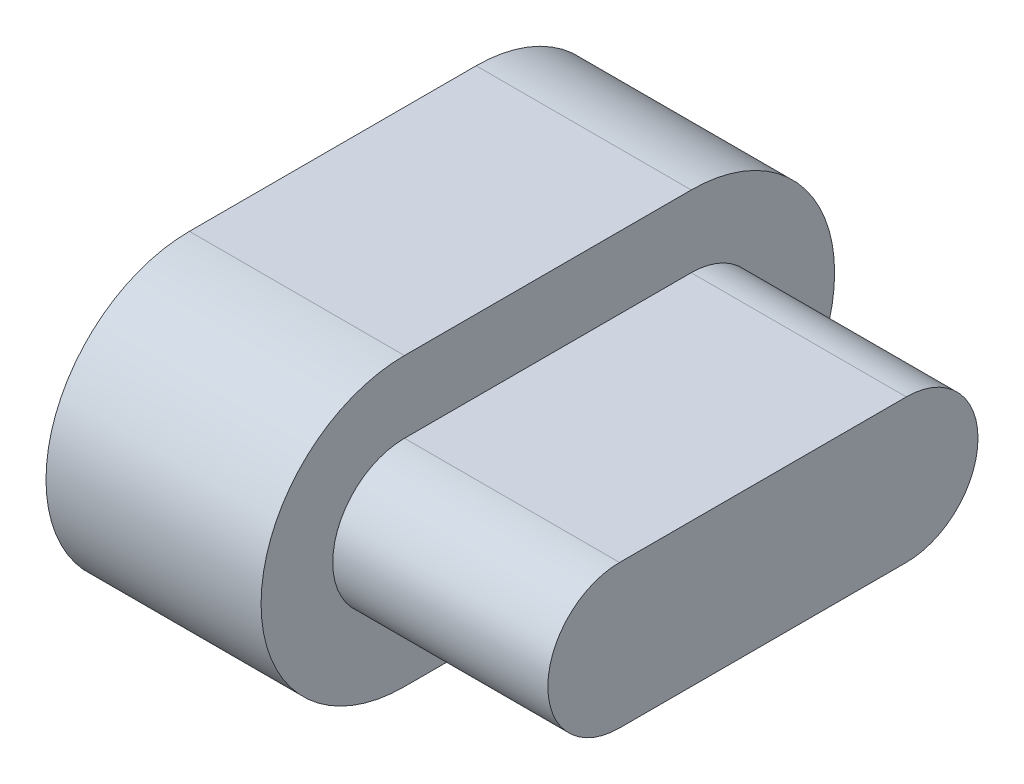
ISO-10303-21;
HEADER;
FILE_DESCRIPTION(('STEP AP214'),'2;1');
FILE_NAME('part.step','',(''),(''),'','','');
FILE_SCHEMA(('AUTOMOTIVE_DESIGN { 1 0 10303 214 1 1 1 1 }'));
ENDSEC;
DATA;
#1=APPLICATION_CONTEXT('core data for automotive mechanical design processes');
#2=APPLICATION_PROTOCOL_DEFINITION('international standard','automotive_design',2000,#1);
#3=PRODUCT_CONTEXT('',#1,'mechanical');
#4=PRODUCT('Part','Part','',(#3));
#5=PRODUCT_RELATED_PRODUCT_CATEGORY('part','',(#4));
#6=PRODUCT_DEFINITION_FORMATION('','',#4);
#7=PRODUCT_DEFINITION_CONTEXT('part definition',#1,'design');
#8=PRODUCT_DEFINITION('design','',#6,#7);
#9=PRODUCT_DEFINITION_SHAPE('','',#8);
#10=(LENGTH_UNIT() NAMED_UNIT(*) SI_UNIT(.MILLI.,.METRE.));
#11=(NAMED_UNIT(*) PLANE_ANGLE_UNIT() SI_UNIT($,.RADIAN.));
#12=(NAMED_UNIT(*) SI_UNIT($,.STERADIAN.) SOLID_ANGLE_UNIT());
#13=UNCERTAINTY_MEASURE_WITH_UNIT(LENGTH_MEASURE(1.E-05),#10,'distance_accuracy_value','');
#14=(GEOMETRIC_REPRESENTATION_CONTEXT(3) GLOBAL_UNCERTAINTY_ASSIGNED_CONTEXT((#13)) GLOBAL_UNIT_ASSIGNED_CONTEXT((#10,
#11,#12)) REPRESENTATION_CONTEXT('',''));
#15=CARTESIAN_POINT('',(0.,0.,0.));
#16=DIRECTION('',(0.,0.,1.));
#17=DIRECTION('',(1.,0.,0.));
#18=AXIS2_PLACEMENT_3D('',#15,#16,#17);
#19=CARTESIAN_POINT('',(3.,0.,2.));
#20=DIRECTION('',(1.,0.,0.));
#21=DIRECTION('',(0.,0.,-1.));
#22=AXIS2_PLACEMENT_3D('',#19,#20,#21);
#23=PLANE('',#22);
#24=CARTESIAN_POINT('',(3.,0.,2.));
#25=DIRECTION('',(1.,0.,0.));
#26=DIRECTION('',(0.,0.,-1.));
#27=AXIS2_PLACEMENT_3D('',#24,#25,#26);
#28=CIRCLE('',#27,2.);
#29=CARTESIAN_POINT('',(3.,2.,2.));
#30=VERTEX_POINT('',#29);
#31=CARTESIAN_POINT('',(3.,-2.,2.));
#32=VERTEX_POINT('',#31);
#33=EDGE_CURVE('E142',#30,#32,#28,.T.);
#34=ORIENTED_EDGE('',*,*,#33,.T.);
#35=DIRECTION('',(0.,0.,-1.));
#36=VECTOR('',#35,1.);
#37=CARTESIAN_POINT('',(3.,-2.,2.));
#38=LINE('',#37,#36);
#39=CARTESIAN_POINT('',(3.,-2.,-2.));
#40=VERTEX_POINT('',#39);
#41=EDGE_CURVE('E87',#32,#40,#38,.T.);
#42=ORIENTED_EDGE('',*,*,#41,.T.);
#43=CARTESIAN_POINT('',(3.,0.,-2.));
#44=DIRECTION('',(1.,0.,0.));
#45=DIRECTION('',(0.,0.,-1.));
#46=AXIS2_PLACEMENT_3D('',#43,#44,#45);
#47=CIRCLE('',#46,2.);
#48=CARTESIAN_POINT('',(3.,2.,-2.));
#49=VERTEX_POINT('',#48);
#50=EDGE_CURVE('E145',#40,#49,#47,.T.);
#51=ORIENTED_EDGE('',*,*,#50,.T.);
#52=DIRECTION('',(0.,0.,1.));
#53=VECTOR('',#52,1.);
#54=CARTESIAN_POINT('',(3.,2.,2.));
#55=LINE('',#54,#53);
#56=EDGE_CURVE('E59',#49,#30,#55,.T.);
#57=ORIENTED_EDGE('',*,*,#56,.T.);
#58=EDGE_LOOP('',(#34,#42,#51,#57));
#59=FACE_BOUND('',#58,.T.);
#60=DIRECTION('',(0.,0.,-1.));
#61=VECTOR('',#60,1.);
#62=CARTESIAN_POINT('',(3.,-1.,2.));
#63=LINE('',#62,#61);
#64=CARTESIAN_POINT('',(3.,-1.,2.));
#65=VERTEX_POINT('',#64);
#66=CARTESIAN_POINT('',(3.,-1.,-2.));
#67=VERTEX_POINT('',#66);
#68=EDGE_CURVE('E265',#65,#67,#63,.T.);
#69=ORIENTED_EDGE('',*,*,#68,.F.);
#70=CARTESIAN_POINT('',(3.,0.,2.));
#71=DIRECTION('',(1.,0.,0.));
#72=DIRECTION('',(0.,0.,-1.));
#73=AXIS2_PLACEMENT_3D('',#70,#71,#72);
#74=CIRCLE('',#73,1.);
#75=CARTESIAN_POINT('',(3.,1.,2.));
#76=VERTEX_POINT('',#75);
#77=EDGE_CURVE('E132',#76,#65,#74,.T.);
#78=ORIENTED_EDGE('',*,*,#77,.F.);
#79=DIRECTION('',(0.,0.,1.));
#80=VECTOR('',#79,1.);
#81=CARTESIAN_POINT('',(3.,1.,-2.));
#82=LINE('',#81,#80);
#83=CARTESIAN_POINT('',(3.,1.,-2.));
#84=VERTEX_POINT('',#83);
#85=EDGE_CURVE('E128',#84,#76,#82,.T.);
#86=ORIENTED_EDGE('',*,*,#85,.F.);
#87=CARTESIAN_POINT('',(3.,0.,-2.));
#88=DIRECTION('',(1.,0.,0.));
#89=DIRECTION('',(0.,0.,-1.));
#90=AXIS2_PLACEMENT_3D('',#87,#88,#89);
#91=CIRCLE('',#90,1.);
#92=EDGE_CURVE('E262',#67,#84,#91,.T.);
#93=ORIENTED_EDGE('',*,*,#92,.F.);
#94=EDGE_LOOP('',(#69,#78,#86,#93));
#95=FACE_BOUND('',#94,.T.);
#96=ADVANCED_FACE('F35',(#59,#95),#23,.T.);
#97=CARTESIAN_POINT('',(3.,0.,2.));
#98=DIRECTION('',(-1.,0.,0.));
#99=DIRECTION('',(0.,0.,1.));
#100=AXIS2_PLACEMENT_3D('',#97,#98,#99);
#101=CYLINDRICAL_SURFACE('',#100,2.);
#102=CARTESIAN_POINT('',(0.,0.,2.));
#103=DIRECTION('',(1.,0.,0.));
#104=DIRECTION('',(0.,0.,-1.));
#105=AXIS2_PLACEMENT_3D('',#102,#103,#104);
#106=CIRCLE('',#105,2.);
#107=CARTESIAN_POINT('',(0.,2.,2.));
#108=VERTEX_POINT('',#107);
#109=CARTESIAN_POINT('',(0.,-2.,2.));
#110=VERTEX_POINT('',#109);
#111=EDGE_CURVE('E134',#108,#110,#106,.T.);
#112=ORIENTED_EDGE('',*,*,#111,.T.);
#113=DIRECTION('',(-1.,0.,0.));
#114=VECTOR('',#113,1.);
#115=CARTESIAN_POINT('',(3.,-2.,2.));
#116=LINE('',#115,#114);
#117=EDGE_CURVE('E11',#32,#110,#116,.T.);
#118=ORIENTED_EDGE('',*,*,#117,.F.);
#119=ORIENTED_EDGE('',*,*,#33,.F.);
#120=DIRECTION('',(-1.,0.,0.));
#121=VECTOR('',#120,1.);
#122=CARTESIAN_POINT('',(3.,2.,2.));
#123=LINE('',#122,#121);
#124=EDGE_CURVE('E147',#30,#108,#123,.T.);
#125=ORIENTED_EDGE('',*,*,#124,.T.);
#126=EDGE_LOOP('',(#112,#118,#119,#125));
#127=FACE_BOUND('',#126,.T.);
#128=ADVANCED_FACE('F37',(#127),#101,.T.);
#129=CARTESIAN_POINT('',(3.,-2.,2.));
#130=DIRECTION('',(0.,1.,0.));
#131=DIRECTION('',(0.,0.,1.));
#132=AXIS2_PLACEMENT_3D('',#129,#130,#131);
#133=PLANE('',#132);
#134=DIRECTION('',(0.,0.,-1.));
#135=VECTOR('',#134,1.);
#136=CARTESIAN_POINT('',(0.,-2.,2.));
#137=LINE('',#136,#135);
#138=CARTESIAN_POINT('',(0.,-2.,-2.));
#139=VERTEX_POINT('',#138);
#140=EDGE_CURVE('E137',#110,#139,#137,.T.);
#141=ORIENTED_EDGE('',*,*,#140,.T.);
#142=DIRECTION('',(-1.,0.,0.));
#143=VECTOR('',#142,1.);
#144=CARTESIAN_POINT('',(3.,-2.,-2.));
#145=LINE('',#144,#143);
#146=EDGE_CURVE('E43',#40,#139,#145,.T.);
#147=ORIENTED_EDGE('',*,*,#146,.F.);
#148=ORIENTED_EDGE('',*,*,#41,.F.);
#149=ORIENTED_EDGE('',*,*,#117,.T.);
#150=EDGE_LOOP('',(#141,#147,#148,#149));
#151=FACE_BOUND('',#150,.T.);
#152=ADVANCED_FACE('F175',(#151),#133,.F.);
#153=CARTESIAN_POINT('',(3.,0.,-2.));
#154=DIRECTION('',(-1.,0.,0.));
#155=DIRECTION('',(0.,0.,1.));
#156=AXIS2_PLACEMENT_3D('',#153,#154,#155);
#157=CYLINDRICAL_SURFACE('',#156,2.);
#158=CARTESIAN_POINT('',(0.,0.,-2.));
#159=DIRECTION('',(1.,0.,0.));
#160=DIRECTION('',(0.,0.,-1.));
#161=AXIS2_PLACEMENT_3D('',#158,#159,#160);
#162=CIRCLE('',#161,2.);
#163=CARTESIAN_POINT('',(0.,2.,-2.));
#164=VERTEX_POINT('',#163);
#165=EDGE_CURVE('E150',#139,#164,#162,.T.);
#166=ORIENTED_EDGE('',*,*,#165,.T.);
#167=DIRECTION('',(-1.,0.,0.));
#168=VECTOR('',#167,1.);
#169=CARTESIAN_POINT('',(3.,2.,-2.));
#170=LINE('',#169,#168);
#171=EDGE_CURVE('E154',#49,#164,#170,.T.);
#172=ORIENTED_EDGE('',*,*,#171,.F.);
#173=ORIENTED_EDGE('',*,*,#50,.F.);
#174=ORIENTED_EDGE('',*,*,#146,.T.);
#175=EDGE_LOOP('',(#166,#172,#173,#174));
#176=FACE_BOUND('',#175,.T.);
#177=ADVANCED_FACE('F159',(#176),#157,.T.);
#178=CARTESIAN_POINT('',(3.,2.,2.));
#179=DIRECTION('',(0.,-1.,0.));
#180=DIRECTION('',(0.,0.,-1.));
#181=AXIS2_PLACEMENT_3D('',#178,#179,#180);
#182=PLANE('',#181);
#183=DIRECTION('',(0.,0.,1.));
#184=VECTOR('',#183,1.);
#185=CARTESIAN_POINT('',(0.,2.,2.));
#186=LINE('',#185,#184);
#187=EDGE_CURVE('E80',#164,#108,#186,.T.);
#188=ORIENTED_EDGE('',*,*,#187,.T.);
#189=ORIENTED_EDGE('',*,*,#124,.F.);
#190=ORIENTED_EDGE('',*,*,#56,.F.);
#191=ORIENTED_EDGE('',*,*,#171,.T.);
#192=EDGE_LOOP('',(#188,#189,#190,#191));
#193=FACE_BOUND('',#192,.T.);
#194=ADVANCED_FACE('F167',(#193),#182,.F.);
#195=CARTESIAN_POINT('',(0.,0.,2.));
#196=DIRECTION('',(1.,0.,0.));
#197=DIRECTION('',(0.,0.,-1.));
#198=AXIS2_PLACEMENT_3D('',#195,#196,#197);
#199=PLANE('',#198);
#200=ORIENTED_EDGE('',*,*,#111,.F.);
#201=ORIENTED_EDGE('',*,*,#187,.F.);
#202=ORIENTED_EDGE('',*,*,#165,.F.);
#203=ORIENTED_EDGE('',*,*,#140,.F.);
#204=EDGE_LOOP('',(#200,#201,#202,#203));
#205=FACE_BOUND('',#204,.T.);
#206=ADVANCED_FACE('F163',(#205),#199,.F.);
#207=CARTESIAN_POINT('',(6.,0.,2.));
#208=DIRECTION('',(-1.,0.,0.));
#209=DIRECTION('',(0.,0.,1.));
#210=AXIS2_PLACEMENT_3D('',#207,#208,#209);
#211=CYLINDRICAL_SURFACE('',#210,1.);
#212=ORIENTED_EDGE('',*,*,#77,.T.);
#213=DIRECTION('',(-1.,0.,0.));
#214=VECTOR('',#213,1.);
#215=CARTESIAN_POINT('',(6.,-1.,2.));
#216=LINE('',#215,#214);
#217=CARTESIAN_POINT('',(6.,-1.,2.));
#218=VERTEX_POINT('',#217);
#219=EDGE_CURVE('E113',#218,#65,#216,.T.);
#220=ORIENTED_EDGE('',*,*,#219,.F.);
#221=CARTESIAN_POINT('',(6.,0.,2.));
#222=DIRECTION('',(1.,0.,0.));
#223=DIRECTION('',(0.,0.,-1.));
#224=AXIS2_PLACEMENT_3D('',#221,#222,#223);
#225=CIRCLE('',#224,1.);
#226=CARTESIAN_POINT('',(6.,1.,2.));
#227=VERTEX_POINT('',#226);
#228=EDGE_CURVE('E120',#227,#218,#225,.T.);
#229=ORIENTED_EDGE('',*,*,#228,.F.);
#230=DIRECTION('',(-1.,0.,0.));
#231=VECTOR('',#230,1.);
#232=CARTESIAN_POINT('',(6.,1.,2.));
#233=LINE('',#232,#231);
#234=EDGE_CURVE('E260',#227,#76,#233,.T.);
#235=ORIENTED_EDGE('',*,*,#234,.T.);
#236=EDGE_LOOP('',(#212,#220,#229,#235));
#237=FACE_BOUND('',#236,.T.);
#238=ADVANCED_FACE('F130',(#237),#211,.T.);
#239=CARTESIAN_POINT('',(6.,-1.,2.));
#240=DIRECTION('',(0.,1.,0.));
#241=DIRECTION('',(0.,0.,1.));
#242=AXIS2_PLACEMENT_3D('',#239,#240,#241);
#243=PLANE('',#242);
#244=ORIENTED_EDGE('',*,*,#68,.T.);
#245=DIRECTION('',(-1.,0.,0.));
#246=VECTOR('',#245,1.);
#247=CARTESIAN_POINT('',(6.,-1.,-2.));
#248=LINE('',#247,#246);
#249=CARTESIAN_POINT('',(6.,-1.,-2.));
#250=VERTEX_POINT('',#249);
#251=EDGE_CURVE('E116',#250,#67,#248,.T.);
#252=ORIENTED_EDGE('',*,*,#251,.F.);
#253=DIRECTION('',(0.,0.,-1.));
#254=VECTOR('',#253,1.);
#255=CARTESIAN_POINT('',(6.,-1.,2.));
#256=LINE('',#255,#254);
#257=EDGE_CURVE('E109',#218,#250,#256,.T.);
#258=ORIENTED_EDGE('',*,*,#257,.F.);
#259=ORIENTED_EDGE('',*,*,#219,.T.);
#260=EDGE_LOOP('',(#244,#252,#258,#259));
#261=FACE_BOUND('',#260,.T.);
#262=ADVANCED_FACE('F111',(#261),#243,.F.);
#263=CARTESIAN_POINT('',(6.,0.,-2.));
#264=DIRECTION('',(-1.,0.,0.));
#265=DIRECTION('',(0.,0.,1.));
#266=AXIS2_PLACEMENT_3D('',#263,#264,#265);
#267=CYLINDRICAL_SURFACE('',#266,1.);
#268=ORIENTED_EDGE('',*,*,#92,.T.);
#269=DIRECTION('',(-1.,0.,0.));
#270=VECTOR('',#269,1.);
#271=CARTESIAN_POINT('',(6.,1.,-2.));
#272=LINE('',#271,#270);
#273=CARTESIAN_POINT('',(6.,1.,-2.));
#274=VERTEX_POINT('',#273);
#275=EDGE_CURVE('E50',#274,#84,#272,.T.);
#276=ORIENTED_EDGE('',*,*,#275,.F.);
#277=CARTESIAN_POINT('',(6.,0.,-2.));
#278=DIRECTION('',(1.,0.,0.));
#279=DIRECTION('',(0.,0.,-1.));
#280=AXIS2_PLACEMENT_3D('',#277,#278,#279);
#281=CIRCLE('',#280,1.);
#282=EDGE_CURVE('E119',#250,#274,#281,.T.);
#283=ORIENTED_EDGE('',*,*,#282,.F.);
#284=ORIENTED_EDGE('',*,*,#251,.T.);
#285=EDGE_LOOP('',(#268,#276,#283,#284));
#286=FACE_BOUND('',#285,.T.);
#287=ADVANCED_FACE('F188',(#286),#267,.T.);
#288=CARTESIAN_POINT('',(6.,1.,-2.));
#289=DIRECTION('',(0.,-1.,0.));
#290=DIRECTION('',(0.,0.,-1.));
#291=AXIS2_PLACEMENT_3D('',#288,#289,#290);
#292=PLANE('',#291);
#293=ORIENTED_EDGE('',*,*,#85,.T.);
#294=ORIENTED_EDGE('',*,*,#234,.F.);
#295=DIRECTION('',(0.,0.,1.));
#296=VECTOR('',#295,1.);
#297=CARTESIAN_POINT('',(6.,1.,-2.));
#298=LINE('',#297,#296);
#299=EDGE_CURVE('E124',#274,#227,#298,.T.);
#300=ORIENTED_EDGE('',*,*,#299,.F.);
#301=ORIENTED_EDGE('',*,*,#275,.T.);
#302=EDGE_LOOP('',(#293,#294,#300,#301));
#303=FACE_BOUND('',#302,.T.);
#304=ADVANCED_FACE('F191',(#303),#292,.F.);
#305=CARTESIAN_POINT('',(6.,0.,2.));
#306=DIRECTION('',(1.,0.,0.));
#307=DIRECTION('',(0.,0.,-1.));
#308=AXIS2_PLACEMENT_3D('',#305,#306,#307);
#309=PLANE('',#308);
#310=ORIENTED_EDGE('',*,*,#228,.T.);
#311=ORIENTED_EDGE('',*,*,#257,.T.);
#312=ORIENTED_EDGE('',*,*,#282,.T.);
#313=ORIENTED_EDGE('',*,*,#299,.T.);
#314=EDGE_LOOP('',(#310,#311,#312,#313));
#315=FACE_BOUND('',#314,.T.);
#316=ADVANCED_FACE('F123',(#315),#309,.T.);
#317=CLOSED_SHELL('',(#96,#128,#152,#177,#194,#206,#238,#262,#287,#304,#316));
#318=MANIFOLD_SOLID_BREP('B2',#317);
#319=ADVANCED_BREP_SHAPE_REPRESENTATION('',(#18,#318),#14);
#320=SHAPE_DEFINITION_REPRESENTATION(#9,#319);
ENDSEC;
END-ISO-10303-21;
